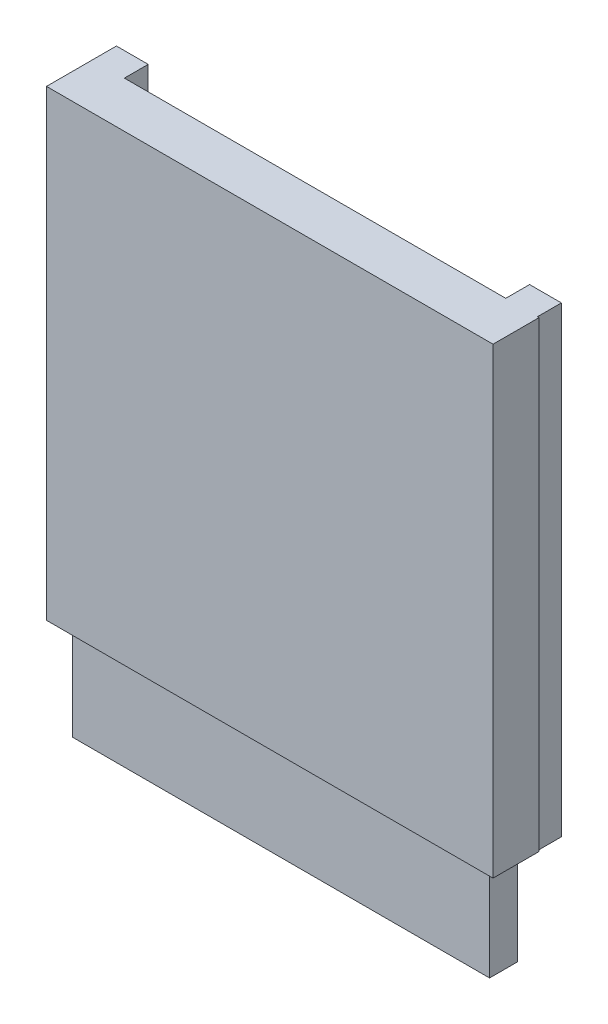
ISO-10303-21;
HEADER;
FILE_DESCRIPTION(('STEP AP214'),'2;1');
FILE_NAME('part.step','',(''),(''),'','','');
FILE_SCHEMA(('AUTOMOTIVE_DESIGN { 1 0 10303 214 1 1 1 1 }'));
ENDSEC;
DATA;
#1=APPLICATION_CONTEXT('core data for automotive mechanical design processes');
#2=APPLICATION_PROTOCOL_DEFINITION('international standard','automotive_design',2000,#1);
#3=PRODUCT_CONTEXT('',#1,'mechanical');
#4=PRODUCT('Part','Part','',(#3));
#5=PRODUCT_RELATED_PRODUCT_CATEGORY('part','',(#4));
#6=PRODUCT_DEFINITION_FORMATION('','',#4);
#7=PRODUCT_DEFINITION_CONTEXT('part definition',#1,'design');
#8=PRODUCT_DEFINITION('design','',#6,#7);
#9=PRODUCT_DEFINITION_SHAPE('','',#8);
#10=(LENGTH_UNIT() NAMED_UNIT(*) SI_UNIT(.MILLI.,.METRE.));
#11=(NAMED_UNIT(*) PLANE_ANGLE_UNIT() SI_UNIT($,.RADIAN.));
#12=(NAMED_UNIT(*) SI_UNIT($,.STERADIAN.) SOLID_ANGLE_UNIT());
#13=UNCERTAINTY_MEASURE_WITH_UNIT(LENGTH_MEASURE(1.E-05),#10,'distance_accuracy_value','');
#14=(GEOMETRIC_REPRESENTATION_CONTEXT(3) GLOBAL_UNCERTAINTY_ASSIGNED_CONTEXT((#13)) GLOBAL_UNIT_ASSIGNED_CONTEXT((#10,
#11,#12)) REPRESENTATION_CONTEXT('',''));
#15=CARTESIAN_POINT('',(0.,0.,0.));
#16=DIRECTION('',(0.,0.,1.));
#17=DIRECTION('',(1.,0.,0.));
#18=AXIS2_PLACEMENT_3D('',#15,#16,#17);
#19=CARTESIAN_POINT('',(26.5754791182011,0.,1.75922698570954));
#20=DIRECTION('',(0.,1.,0.));
#21=DIRECTION('',(0.,0.,1.));
#22=AXIS2_PLACEMENT_3D('',#19,#20,#21);
#23=PLANE('',#22);
#24=DIRECTION('',(0.,0.,1.));
#25=VECTOR('',#24,1.);
#26=CARTESIAN_POINT('',(26.5754791182011,0.,4.03163199291016));
#27=LINE('',#26,#25);
#28=CARTESIAN_POINT('',(26.5754791182011,0.,1.75922698570954));
#29=VERTEX_POINT('',#28);
#30=CARTESIAN_POINT('',(26.5754791182011,0.,4.03163199291016));
#31=VERTEX_POINT('',#30);
#32=EDGE_CURVE('E196',#29,#31,#27,.T.);
#33=ORIENTED_EDGE('',*,*,#32,.T.);
#34=DIRECTION('',(-1.,0.,0.));
#35=VECTOR('',#34,1.);
#36=CARTESIAN_POINT('',(26.5754791182011,0.,4.03163199291016));
#37=LINE('',#36,#35);
#38=CARTESIAN_POINT('',(-0.506607953915927,0.,4.03163199291016));
#39=VERTEX_POINT('',#38);
#40=EDGE_CURVE('E199',#31,#39,#37,.T.);
#41=ORIENTED_EDGE('',*,*,#40,.T.);
#42=DIRECTION('',(0.,0.,-1.));
#43=VECTOR('',#42,1.);
#44=CARTESIAN_POINT('',(-0.506607953915927,0.,4.03163199291016));
#45=LINE('',#44,#43);
#46=CARTESIAN_POINT('',(-0.506607953915927,0.,1.75922698570954));
#47=VERTEX_POINT('',#46);
#48=EDGE_CURVE('E202',#39,#47,#45,.T.);
#49=ORIENTED_EDGE('',*,*,#48,.T.);
#50=DIRECTION('',(1.,0.,0.));
#51=VECTOR('',#50,1.);
#52=CARTESIAN_POINT('',(26.5754791182011,0.,1.75922698570954));
#53=LINE('',#52,#51);
#54=EDGE_CURVE('E205',#47,#29,#53,.T.);
#55=ORIENTED_EDGE('',*,*,#54,.T.);
#56=EDGE_LOOP('',(#33,#41,#49,#55));
#57=FACE_BOUND('',#56,.T.);
#58=DIRECTION('',(0.,0.,1.));
#59=VECTOR('',#58,1.);
#60=CARTESIAN_POINT('',(26.233061925335,0.,3.75147247147447));
#61=LINE('',#60,#59);
#62=CARTESIAN_POINT('',(26.233061925335,0.,2.00825767143015));
#63=VERTEX_POINT('',#62);
#64=CARTESIAN_POINT('',(26.233061925335,0.,3.75147247147447));
#65=VERTEX_POINT('',#64);
#66=EDGE_CURVE('E153',#63,#65,#61,.T.);
#67=ORIENTED_EDGE('',*,*,#66,.F.);
#68=DIRECTION('',(1.,0.,0.));
#69=VECTOR('',#68,1.);
#70=CARTESIAN_POINT('',(26.233061925335,0.,2.00825767143015));
#71=LINE('',#70,#69);
#72=CARTESIAN_POINT('',(0.,0.,2.00825767143015));
#73=VERTEX_POINT('',#72);
#74=EDGE_CURVE('E155',#73,#63,#71,.T.);
#75=ORIENTED_EDGE('',*,*,#74,.F.);
#76=DIRECTION('',(0.,0.,-1.));
#77=VECTOR('',#76,1.);
#78=CARTESIAN_POINT('',(0.,0.,3.75147247147447));
#79=LINE('',#78,#77);
#80=CARTESIAN_POINT('',(0.,0.,3.75147247147447));
#81=VERTEX_POINT('',#80);
#82=EDGE_CURVE('E52',#81,#73,#79,.T.);
#83=ORIENTED_EDGE('',*,*,#82,.F.);
#84=DIRECTION('',(-1.,0.,0.));
#85=VECTOR('',#84,1.);
#86=CARTESIAN_POINT('',(26.233061925335,0.,3.75147247147447));
#87=LINE('',#86,#85);
#88=EDGE_CURVE('E47',#65,#81,#87,.T.);
#89=ORIENTED_EDGE('',*,*,#88,.F.);
#90=EDGE_LOOP('',(#67,#75,#83,#89));
#91=FACE_BOUND('',#90,.T.);
#92=ADVANCED_FACE('F29',(#57,#91),#23,.F.);
#93=CARTESIAN_POINT('',(-0.999999999999997,-26.3,1.5));
#94=DIRECTION('',(0.,0.,1.));
#95=DIRECTION('',(1.,0.,0.));
#96=AXIS2_PLACEMENT_3D('',#93,#94,#95);
#97=PLANE('',#96);
#98=DIRECTION('',(0.,-1.,0.));
#99=VECTOR('',#98,1.);
#100=CARTESIAN_POINT('',(25.,2.8,1.5));
#101=LINE('',#100,#99);
#102=CARTESIAN_POINT('',(25.,2.8,1.5));
#103=VERTEX_POINT('',#102);
#104=CARTESIAN_POINT('',(25.,-26.3,1.5));
#105=VERTEX_POINT('',#104);
#106=EDGE_CURVE('E226',#103,#105,#101,.T.);
#107=ORIENTED_EDGE('',*,*,#106,.T.);
#108=DIRECTION('',(1.,0.,0.));
#109=VECTOR('',#108,1.);
#110=CARTESIAN_POINT('',(-0.999999999999997,-26.3,1.5));
#111=LINE('',#110,#109);
#112=CARTESIAN_POINT('',(1.,-26.3,1.5));
#113=VERTEX_POINT('',#112);
#114=EDGE_CURVE('E256',#113,#105,#111,.T.);
#115=ORIENTED_EDGE('',*,*,#114,.F.);
#116=DIRECTION('',(0.,1.,0.));
#117=VECTOR('',#116,1.);
#118=CARTESIAN_POINT('',(1.,2.8,1.5));
#119=LINE('',#118,#117);
#120=CARTESIAN_POINT('',(1.,2.8,1.5));
#121=VERTEX_POINT('',#120);
#122=EDGE_CURVE('E267',#113,#121,#119,.T.);
#123=ORIENTED_EDGE('',*,*,#122,.T.);
#124=DIRECTION('',(-1.,0.,0.));
#125=VECTOR('',#124,1.);
#126=CARTESIAN_POINT('',(-1.,2.8,1.5));
#127=LINE('',#126,#125);
#128=EDGE_CURVE('E33',#103,#121,#127,.T.);
#129=ORIENTED_EDGE('',*,*,#128,.F.);
#130=EDGE_LOOP('',(#107,#115,#123,#129));
#131=FACE_BOUND('',#130,.T.);
#132=ADVANCED_FACE('F352',(#131),#97,.F.);
#133=DIRECTION('',(0.,1.,0.));
#134=VECTOR('',#133,1.);
#135=CARTESIAN_POINT('',(27.,2.8,1.5));
#136=LINE('',#135,#134);
#137=CARTESIAN_POINT('',(27.,-26.3,1.5));
#138=VERTEX_POINT('',#137);
#139=CARTESIAN_POINT('',(27.,2.8,1.5));
#140=VERTEX_POINT('',#139);
#141=EDGE_CURVE('E229',#138,#140,#136,.T.);
#142=ORIENTED_EDGE('',*,*,#141,.T.);
#143=CARTESIAN_POINT('',(27.1,2.8,1.5));
#144=VERTEX_POINT('',#143);
#145=EDGE_CURVE('E315',#144,#140,#127,.T.);
#146=ORIENTED_EDGE('',*,*,#145,.F.);
#147=DIRECTION('',(0.,1.,0.));
#148=VECTOR('',#147,1.);
#149=CARTESIAN_POINT('',(27.1,2.8,1.5));
#150=LINE('',#149,#148);
#151=CARTESIAN_POINT('',(27.1,-26.3,1.5));
#152=VERTEX_POINT('',#151);
#153=EDGE_CURVE('E253',#152,#144,#150,.T.);
#154=ORIENTED_EDGE('',*,*,#153,.F.);
#155=EDGE_CURVE('E250',#138,#152,#111,.T.);
#156=ORIENTED_EDGE('',*,*,#155,.F.);
#157=EDGE_LOOP('',(#142,#146,#154,#156));
#158=FACE_BOUND('',#157,.T.);
#159=ADVANCED_FACE('F340',(#158),#97,.F.);
#160=CARTESIAN_POINT('',(0.,0.,-0.508));
#161=DIRECTION('',(0.,0.,1.));
#162=DIRECTION('',(1.,0.,0.));
#163=AXIS2_PLACEMENT_3D('',#160,#161,#162);
#164=CYLINDRICAL_SURFACE('',#163,0.5);
#165=CARTESIAN_POINT('',(0.,0.,-0.508));
#166=DIRECTION('',(0.,0.,1.));
#167=DIRECTION('',(1.,0.,0.));
#168=AXIS2_PLACEMENT_3D('',#165,#166,#167);
#169=CIRCLE('',#168,0.5);
#170=CARTESIAN_POINT('',(0.5,0.,-0.508));
#171=VERTEX_POINT('',#170);
#172=EDGE_CURVE('E11',#171,#171,#169,.T.);
#173=ORIENTED_EDGE('',*,*,#172,.T.);
#174=EDGE_LOOP('',(#173));
#175=FACE_BOUND('',#174,.T.);
#176=CARTESIAN_POINT('',(0.,0.,0.));
#177=DIRECTION('',(0.,0.,1.));
#178=DIRECTION('',(1.,0.,0.));
#179=AXIS2_PLACEMENT_3D('',#176,#177,#178);
#180=CIRCLE('',#179,0.5);
#181=CARTESIAN_POINT('',(0.5,0.,0.));
#182=VERTEX_POINT('',#181);
#183=EDGE_CURVE('E39',#182,#182,#180,.T.);
#184=ORIENTED_EDGE('',*,*,#183,.F.);
#185=EDGE_LOOP('',(#184));
#186=FACE_BOUND('',#185,.T.);
#187=ADVANCED_FACE('F31',(#175,#186),#164,.T.);
#188=CARTESIAN_POINT('',(0.,0.,-0.508));
#189=DIRECTION('',(0.,0.,1.));
#190=DIRECTION('',(1.,0.,0.));
#191=AXIS2_PLACEMENT_3D('',#188,#189,#190);
#192=PLANE('',#191);
#193=ORIENTED_EDGE('',*,*,#172,.F.);
#194=EDGE_LOOP('',(#193));
#195=FACE_BOUND('',#194,.T.);
#196=ADVANCED_FACE('F417',(#195),#192,.F.);
#197=CARTESIAN_POINT('',(-1.,2.8,1.5));
#198=DIRECTION('',(1.,0.,0.));
#199=DIRECTION('',(0.,1.,0.));
#200=AXIS2_PLACEMENT_3D('',#197,#198,#199);
#201=PLANE('',#200);
#202=DIRECTION('',(0.,-1.,0.));
#203=VECTOR('',#202,1.);
#204=CARTESIAN_POINT('',(-1.,2.8,0.));
#205=LINE('',#204,#203);
#206=CARTESIAN_POINT('',(-1.,2.8,0.));
#207=VERTEX_POINT('',#206);
#208=CARTESIAN_POINT('',(-0.999999999999997,-26.3,0.));
#209=VERTEX_POINT('',#208);
#210=EDGE_CURVE('E299',#207,#209,#205,.T.);
#211=ORIENTED_EDGE('',*,*,#210,.T.);
#212=DIRECTION('',(0.,0.,-1.));
#213=VECTOR('',#212,1.);
#214=CARTESIAN_POINT('',(-0.999999999999997,-26.3,1.5));
#215=LINE('',#214,#213);
#216=CARTESIAN_POINT('',(-0.999999999999997,-26.3,4.4));
#217=VERTEX_POINT('',#216);
#218=EDGE_CURVE('E265',#217,#209,#215,.T.);
#219=ORIENTED_EDGE('',*,*,#218,.F.);
#220=DIRECTION('',(0.,-1.,0.));
#221=VECTOR('',#220,1.);
#222=CARTESIAN_POINT('',(-1.,2.8,4.4));
#223=LINE('',#222,#221);
#224=CARTESIAN_POINT('',(-1.,2.8,4.4));
#225=VERTEX_POINT('',#224);
#226=EDGE_CURVE('E317',#225,#217,#223,.T.);
#227=ORIENTED_EDGE('',*,*,#226,.F.);
#228=DIRECTION('',(0.,0.,-1.));
#229=VECTOR('',#228,1.);
#230=CARTESIAN_POINT('',(-1.,2.8,1.5));
#231=LINE('',#230,#229);
#232=EDGE_CURVE('E271',#225,#207,#231,.T.);
#233=ORIENTED_EDGE('',*,*,#232,.T.);
#234=EDGE_LOOP('',(#211,#219,#227,#233));
#235=FACE_BOUND('',#234,.T.);
#236=ADVANCED_FACE('F332',(#235),#201,.F.);
#237=CARTESIAN_POINT('',(-0.999999999999997,-26.3,1.5));
#238=DIRECTION('',(0.,1.,0.));
#239=DIRECTION('',(0.,0.,1.));
#240=AXIS2_PLACEMENT_3D('',#237,#238,#239);
#241=PLANE('',#240);
#242=DIRECTION('',(-1.,0.,0.));
#243=VECTOR('',#242,1.);
#244=CARTESIAN_POINT('',(26.5754791182011,-26.3,4.03163199291016));
#245=LINE('',#244,#243);
#246=CARTESIAN_POINT('',(26.5754791182011,-26.3,4.03163199291016));
#247=VERTEX_POINT('',#246);
#248=CARTESIAN_POINT('',(-0.506607953915927,-26.3,4.03163199291016));
#249=VERTEX_POINT('',#248);
#250=EDGE_CURVE('E187',#247,#249,#245,.T.);
#251=ORIENTED_EDGE('',*,*,#250,.F.);
#252=DIRECTION('',(0.,0.,1.));
#253=VECTOR('',#252,1.);
#254=CARTESIAN_POINT('',(26.5754791182011,-26.3,4.03163199291016));
#255=LINE('',#254,#253);
#256=CARTESIAN_POINT('',(26.5754791182011,-26.3,1.75922698570954));
#257=VERTEX_POINT('',#256);
#258=EDGE_CURVE('E185',#257,#247,#255,.T.);
#259=ORIENTED_EDGE('',*,*,#258,.F.);
#260=DIRECTION('',(1.,0.,0.));
#261=VECTOR('',#260,1.);
#262=CARTESIAN_POINT('',(26.5754791182011,-26.3,1.75922698570954));
#263=LINE('',#262,#261);
#264=CARTESIAN_POINT('',(-0.506607953915927,-26.3,1.75922698570954));
#265=VERTEX_POINT('',#264);
#266=EDGE_CURVE('E193',#265,#257,#263,.T.);
#267=ORIENTED_EDGE('',*,*,#266,.F.);
#268=DIRECTION('',(0.,0.,-1.));
#269=VECTOR('',#268,1.);
#270=CARTESIAN_POINT('',(-0.506607953915927,-26.3,4.03163199291016));
#271=LINE('',#270,#269);
#272=EDGE_CURVE('E190',#249,#265,#271,.T.);
#273=ORIENTED_EDGE('',*,*,#272,.F.);
#274=EDGE_LOOP('',(#251,#259,#267,#273));
#275=FACE_BOUND('',#274,.T.);
#276=DIRECTION('',(1.,0.,0.));
#277=VECTOR('',#276,1.);
#278=CARTESIAN_POINT('',(-0.999999999999997,-26.3,0.));
#279=LINE('',#278,#277);
#280=CARTESIAN_POINT('',(1.,-26.3,0.));
#281=VERTEX_POINT('',#280);
#282=EDGE_CURVE('E300',#209,#281,#279,.T.);
#283=ORIENTED_EDGE('',*,*,#282,.T.);
#284=DIRECTION('',(0.,0.,-1.));
#285=VECTOR('',#284,1.);
#286=CARTESIAN_POINT('',(1.,-26.3,1.5));
#287=LINE('',#286,#285);
#288=EDGE_CURVE('E262',#113,#281,#287,.T.);
#289=ORIENTED_EDGE('',*,*,#288,.F.);
#290=ORIENTED_EDGE('',*,*,#114,.T.);
#291=DIRECTION('',(0.,0.,-1.));
#292=VECTOR('',#291,1.);
#293=CARTESIAN_POINT('',(25.,-26.3,1.5));
#294=LINE('',#293,#292);
#295=CARTESIAN_POINT('',(25.,-26.3,0.));
#296=VERTEX_POINT('',#295);
#297=EDGE_CURVE('E241',#105,#296,#294,.T.);
#298=ORIENTED_EDGE('',*,*,#297,.T.);
#299=DIRECTION('',(1.,0.,0.));
#300=VECTOR('',#299,1.);
#301=CARTESIAN_POINT('',(25.,-26.3,0.));
#302=LINE('',#301,#300);
#303=CARTESIAN_POINT('',(27.,-26.3,0.));
#304=VERTEX_POINT('',#303);
#305=EDGE_CURVE('E220',#296,#304,#302,.T.);
#306=ORIENTED_EDGE('',*,*,#305,.T.);
#307=DIRECTION('',(0.,0.,-1.));
#308=VECTOR('',#307,1.);
#309=CARTESIAN_POINT('',(27.,-26.3,1.5));
#310=LINE('',#309,#308);
#311=EDGE_CURVE('E238',#138,#304,#310,.T.);
#312=ORIENTED_EDGE('',*,*,#311,.F.);
#313=ORIENTED_EDGE('',*,*,#155,.T.);
#314=DIRECTION('',(0.,0.,-1.));
#315=VECTOR('',#314,1.);
#316=CARTESIAN_POINT('',(27.1,-26.3,4.4));
#317=LINE('',#316,#315);
#318=CARTESIAN_POINT('',(27.1,-26.3,4.4));
#319=VERTEX_POINT('',#318);
#320=EDGE_CURVE('E302',#319,#152,#317,.T.);
#321=ORIENTED_EDGE('',*,*,#320,.F.);
#322=DIRECTION('',(1.,0.,0.));
#323=VECTOR('',#322,1.);
#324=CARTESIAN_POINT('',(-0.999999999999997,-26.3,4.4));
#325=LINE('',#324,#323);
#326=EDGE_CURVE('E323',#217,#319,#325,.T.);
#327=ORIENTED_EDGE('',*,*,#326,.F.);
#328=ORIENTED_EDGE('',*,*,#218,.T.);
#329=EDGE_LOOP('',(#283,#289,#290,#298,#306,#312,#313,#321,#327,#328));
#330=FACE_BOUND('',#329,.T.);
#331=ADVANCED_FACE('F335',(#275,#330),#241,.F.);
#332=CARTESIAN_POINT('',(1.,2.8,1.5));
#333=DIRECTION('',(-1.,0.,0.));
#334=DIRECTION('',(0.,-1.,0.));
#335=AXIS2_PLACEMENT_3D('',#332,#333,#334);
#336=PLANE('',#335);
#337=DIRECTION('',(0.,1.,0.));
#338=VECTOR('',#337,1.);
#339=CARTESIAN_POINT('',(1.,2.8,0.));
#340=LINE('',#339,#338);
#341=CARTESIAN_POINT('',(1.,2.8,0.));
#342=VERTEX_POINT('',#341);
#343=EDGE_CURVE('E297',#281,#342,#340,.T.);
#344=ORIENTED_EDGE('',*,*,#343,.T.);
#345=DIRECTION('',(0.,0.,-1.));
#346=VECTOR('',#345,1.);
#347=CARTESIAN_POINT('',(1.,2.8,1.5));
#348=LINE('',#347,#346);
#349=EDGE_CURVE('E266',#121,#342,#348,.T.);
#350=ORIENTED_EDGE('',*,*,#349,.F.);
#351=ORIENTED_EDGE('',*,*,#122,.F.);
#352=ORIENTED_EDGE('',*,*,#288,.T.);
#353=EDGE_LOOP('',(#344,#350,#351,#352));
#354=FACE_BOUND('',#353,.T.);
#355=ADVANCED_FACE('F355',(#354),#336,.F.);
#356=CARTESIAN_POINT('',(-1.,2.8,1.5));
#357=DIRECTION('',(0.,-1.,0.));
#358=DIRECTION('',(0.,0.,-1.));
#359=AXIS2_PLACEMENT_3D('',#356,#357,#358);
#360=PLANE('',#359);
#361=DIRECTION('',(-1.,0.,0.));
#362=VECTOR('',#361,1.);
#363=CARTESIAN_POINT('',(-1.,2.8,0.));
#364=LINE('',#363,#362);
#365=EDGE_CURVE('E272',#342,#207,#364,.T.);
#366=ORIENTED_EDGE('',*,*,#365,.T.);
#367=ORIENTED_EDGE('',*,*,#232,.F.);
#368=DIRECTION('',(-1.,0.,0.));
#369=VECTOR('',#368,1.);
#370=CARTESIAN_POINT('',(-1.,2.8,4.4));
#371=LINE('',#370,#369);
#372=CARTESIAN_POINT('',(27.1,2.8,4.4));
#373=VERTEX_POINT('',#372);
#374=EDGE_CURVE('E312',#373,#225,#371,.T.);
#375=ORIENTED_EDGE('',*,*,#374,.F.);
#376=DIRECTION('',(0.,0.,-1.));
#377=VECTOR('',#376,1.);
#378=CARTESIAN_POINT('',(27.1,2.8,4.4));
#379=LINE('',#378,#377);
#380=EDGE_CURVE('E305',#373,#144,#379,.T.);
#381=ORIENTED_EDGE('',*,*,#380,.T.);
#382=ORIENTED_EDGE('',*,*,#145,.T.);
#383=DIRECTION('',(0.,0.,-1.));
#384=VECTOR('',#383,1.);
#385=CARTESIAN_POINT('',(27.,2.8,1.5));
#386=LINE('',#385,#384);
#387=CARTESIAN_POINT('',(27.,2.8,0.));
#388=VERTEX_POINT('',#387);
#389=EDGE_CURVE('E235',#140,#388,#386,.T.);
#390=ORIENTED_EDGE('',*,*,#389,.T.);
#391=DIRECTION('',(-1.,0.,0.));
#392=VECTOR('',#391,1.);
#393=CARTESIAN_POINT('',(25.,2.8,0.));
#394=LINE('',#393,#392);
#395=CARTESIAN_POINT('',(25.,2.8,0.));
#396=VERTEX_POINT('',#395);
#397=EDGE_CURVE('E224',#388,#396,#394,.T.);
#398=ORIENTED_EDGE('',*,*,#397,.T.);
#399=DIRECTION('',(0.,0.,-1.));
#400=VECTOR('',#399,1.);
#401=CARTESIAN_POINT('',(25.,2.8,1.5));
#402=LINE('',#401,#400);
#403=EDGE_CURVE('E232',#103,#396,#402,.T.);
#404=ORIENTED_EDGE('',*,*,#403,.F.);
#405=ORIENTED_EDGE('',*,*,#128,.T.);
#406=ORIENTED_EDGE('',*,*,#349,.T.);
#407=EDGE_LOOP('',(#366,#367,#375,#381,#382,#390,#398,#404,#405,#406));
#408=FACE_BOUND('',#407,.T.);
#409=ADVANCED_FACE('F288',(#408),#360,.F.);
#410=CARTESIAN_POINT('',(-0.999999999999997,-26.3,0.));
#411=DIRECTION('',(0.,0.,1.));
#412=DIRECTION('',(1.,0.,0.));
#413=AXIS2_PLACEMENT_3D('',#410,#411,#412);
#414=PLANE('',#413);
#415=ORIENTED_EDGE('',*,*,#183,.T.);
#416=EDGE_LOOP('',(#415));
#417=FACE_BOUND('',#416,.T.);
#418=ORIENTED_EDGE('',*,*,#210,.F.);
#419=ORIENTED_EDGE('',*,*,#365,.F.);
#420=ORIENTED_EDGE('',*,*,#343,.F.);
#421=ORIENTED_EDGE('',*,*,#282,.F.);
#422=EDGE_LOOP('',(#418,#419,#420,#421));
#423=FACE_BOUND('',#422,.T.);
#424=ADVANCED_FACE('F296',(#417,#423),#414,.F.);
#425=CARTESIAN_POINT('',(27.1,2.8,4.4));
#426=DIRECTION('',(-1.,0.,0.));
#427=DIRECTION('',(0.,-1.,0.));
#428=AXIS2_PLACEMENT_3D('',#425,#426,#427);
#429=PLANE('',#428);
#430=ORIENTED_EDGE('',*,*,#153,.T.);
#431=ORIENTED_EDGE('',*,*,#380,.F.);
#432=DIRECTION('',(0.,1.,0.));
#433=VECTOR('',#432,1.);
#434=CARTESIAN_POINT('',(27.1,2.8,4.4));
#435=LINE('',#434,#433);
#436=EDGE_CURVE('E325',#319,#373,#435,.T.);
#437=ORIENTED_EDGE('',*,*,#436,.F.);
#438=ORIENTED_EDGE('',*,*,#320,.T.);
#439=EDGE_LOOP('',(#430,#431,#437,#438));
#440=FACE_BOUND('',#439,.T.);
#441=ADVANCED_FACE('F337',(#440),#429,.F.);
#442=CARTESIAN_POINT('',(-0.999999999999997,-26.3,4.4));
#443=DIRECTION('',(0.,0.,1.));
#444=DIRECTION('',(1.,0.,0.));
#445=AXIS2_PLACEMENT_3D('',#442,#443,#444);
#446=PLANE('',#445);
#447=ORIENTED_EDGE('',*,*,#226,.T.);
#448=ORIENTED_EDGE('',*,*,#326,.T.);
#449=ORIENTED_EDGE('',*,*,#436,.T.);
#450=ORIENTED_EDGE('',*,*,#374,.T.);
#451=EDGE_LOOP('',(#447,#448,#449,#450));
#452=FACE_BOUND('',#451,.T.);
#453=ADVANCED_FACE('F330',(#452),#446,.T.);
#454=CARTESIAN_POINT('',(26.,0.,-0.508));
#455=DIRECTION('',(0.,0.,1.));
#456=DIRECTION('',(1.,0.,0.));
#457=AXIS2_PLACEMENT_3D('',#454,#455,#456);
#458=CYLINDRICAL_SURFACE('',#457,0.499999999999999);
#459=CARTESIAN_POINT('',(26.,0.,-0.508));
#460=DIRECTION('',(0.,0.,1.));
#461=DIRECTION('',(1.,0.,0.));
#462=AXIS2_PLACEMENT_3D('',#459,#460,#461);
#463=CIRCLE('',#462,0.499999999999999);
#464=CARTESIAN_POINT('',(26.5,0.,-0.508));
#465=VERTEX_POINT('',#464);
#466=EDGE_CURVE('E247',#465,#465,#463,.T.);
#467=ORIENTED_EDGE('',*,*,#466,.T.);
#468=EDGE_LOOP('',(#467));
#469=FACE_BOUND('',#468,.T.);
#470=CARTESIAN_POINT('',(26.,0.,0.));
#471=DIRECTION('',(0.,0.,1.));
#472=DIRECTION('',(1.,0.,0.));
#473=AXIS2_PLACEMENT_3D('',#470,#471,#472);
#474=CIRCLE('',#473,0.499999999999999);
#475=CARTESIAN_POINT('',(26.5,0.,0.));
#476=VERTEX_POINT('',#475);
#477=EDGE_CURVE('E244',#476,#476,#474,.T.);
#478=ORIENTED_EDGE('',*,*,#477,.F.);
#479=EDGE_LOOP('',(#478));
#480=FACE_BOUND('',#479,.T.);
#481=ADVANCED_FACE('F401',(#469,#480),#458,.T.);
#482=CARTESIAN_POINT('',(26.,0.,-0.508));
#483=DIRECTION('',(0.,0.,1.));
#484=DIRECTION('',(1.,0.,0.));
#485=AXIS2_PLACEMENT_3D('',#482,#483,#484);
#486=PLANE('',#485);
#487=ORIENTED_EDGE('',*,*,#466,.F.);
#488=EDGE_LOOP('',(#487));
#489=FACE_BOUND('',#488,.T.);
#490=ADVANCED_FACE('F398',(#489),#486,.F.);
#491=CARTESIAN_POINT('',(25.,2.8,1.5));
#492=DIRECTION('',(1.,0.,0.));
#493=DIRECTION('',(0.,1.,0.));
#494=AXIS2_PLACEMENT_3D('',#491,#492,#493);
#495=PLANE('',#494);
#496=DIRECTION('',(0.,-1.,0.));
#497=VECTOR('',#496,1.);
#498=CARTESIAN_POINT('',(25.,2.8,0.));
#499=LINE('',#498,#497);
#500=EDGE_CURVE('E211',#396,#296,#499,.T.);
#501=ORIENTED_EDGE('',*,*,#500,.T.);
#502=ORIENTED_EDGE('',*,*,#297,.F.);
#503=ORIENTED_EDGE('',*,*,#106,.F.);
#504=ORIENTED_EDGE('',*,*,#403,.T.);
#505=EDGE_LOOP('',(#501,#502,#503,#504));
#506=FACE_BOUND('',#505,.T.);
#507=ADVANCED_FACE('F350',(#506),#495,.F.);
#508=CARTESIAN_POINT('',(27.,2.8,1.5));
#509=DIRECTION('',(-1.,0.,0.));
#510=DIRECTION('',(0.,-1.,0.));
#511=AXIS2_PLACEMENT_3D('',#508,#509,#510);
#512=PLANE('',#511);
#513=DIRECTION('',(0.,1.,0.));
#514=VECTOR('',#513,1.);
#515=CARTESIAN_POINT('',(27.,2.8,0.));
#516=LINE('',#515,#514);
#517=EDGE_CURVE('E222',#304,#388,#516,.T.);
#518=ORIENTED_EDGE('',*,*,#517,.T.);
#519=ORIENTED_EDGE('',*,*,#389,.F.);
#520=ORIENTED_EDGE('',*,*,#141,.F.);
#521=ORIENTED_EDGE('',*,*,#311,.T.);
#522=EDGE_LOOP('',(#518,#519,#520,#521));
#523=FACE_BOUND('',#522,.T.);
#524=ADVANCED_FACE('F343',(#523),#512,.F.);
#525=CARTESIAN_POINT('',(25.,-26.3,0.));
#526=DIRECTION('',(0.,0.,1.));
#527=DIRECTION('',(1.,0.,0.));
#528=AXIS2_PLACEMENT_3D('',#525,#526,#527);
#529=PLANE('',#528);
#530=ORIENTED_EDGE('',*,*,#477,.T.);
#531=EDGE_LOOP('',(#530));
#532=FACE_BOUND('',#531,.T.);
#533=ORIENTED_EDGE('',*,*,#500,.F.);
#534=ORIENTED_EDGE('',*,*,#397,.F.);
#535=ORIENTED_EDGE('',*,*,#517,.F.);
#536=ORIENTED_EDGE('',*,*,#305,.F.);
#537=EDGE_LOOP('',(#533,#534,#535,#536));
#538=FACE_BOUND('',#537,.T.);
#539=ADVANCED_FACE('F348',(#532,#538),#529,.F.);
#540=CARTESIAN_POINT('',(26.5754791182011,0.,4.03163199291016));
#541=DIRECTION('',(1.,0.,0.));
#542=DIRECTION('',(0.,0.,-1.));
#543=AXIS2_PLACEMENT_3D('',#540,#541,#542);
#544=PLANE('',#543);
#545=ORIENTED_EDGE('',*,*,#258,.T.);
#546=DIRECTION('',(0.,-1.,0.));
#547=VECTOR('',#546,1.);
#548=CARTESIAN_POINT('',(26.5754791182011,0.,4.03163199291016));
#549=LINE('',#548,#547);
#550=EDGE_CURVE('E208',#31,#247,#549,.T.);
#551=ORIENTED_EDGE('',*,*,#550,.F.);
#552=ORIENTED_EDGE('',*,*,#32,.F.);
#553=DIRECTION('',(0.,-1.,0.));
#554=VECTOR('',#553,1.);
#555=CARTESIAN_POINT('',(26.5754791182011,0.,1.75922698570954));
#556=LINE('',#555,#554);
#557=EDGE_CURVE('E209',#29,#257,#556,.T.);
#558=ORIENTED_EDGE('',*,*,#557,.T.);
#559=EDGE_LOOP('',(#545,#551,#552,#558));
#560=FACE_BOUND('',#559,.T.);
#561=ADVANCED_FACE('F379',(#560),#544,.F.);
#562=CARTESIAN_POINT('',(26.5754791182011,0.,1.75922698570954));
#563=DIRECTION('',(0.,0.,-1.));
#564=DIRECTION('',(-1.,0.,0.));
#565=AXIS2_PLACEMENT_3D('',#562,#563,#564);
#566=PLANE('',#565);
#567=ORIENTED_EDGE('',*,*,#266,.T.);
#568=ORIENTED_EDGE('',*,*,#557,.F.);
#569=ORIENTED_EDGE('',*,*,#54,.F.);
#570=DIRECTION('',(0.,-1.,0.));
#571=VECTOR('',#570,1.);
#572=CARTESIAN_POINT('',(-0.506607953915927,0.,1.75922698570954));
#573=LINE('',#572,#571);
#574=EDGE_CURVE('E212',#47,#265,#573,.T.);
#575=ORIENTED_EDGE('',*,*,#574,.T.);
#576=EDGE_LOOP('',(#567,#568,#569,#575));
#577=FACE_BOUND('',#576,.T.);
#578=ADVANCED_FACE('F375',(#577),#566,.F.);
#579=CARTESIAN_POINT('',(-0.506607953915927,0.,4.03163199291016));
#580=DIRECTION('',(-1.,0.,0.));
#581=DIRECTION('',(0.,0.,1.));
#582=AXIS2_PLACEMENT_3D('',#579,#580,#581);
#583=PLANE('',#582);
#584=ORIENTED_EDGE('',*,*,#272,.T.);
#585=ORIENTED_EDGE('',*,*,#574,.F.);
#586=ORIENTED_EDGE('',*,*,#48,.F.);
#587=DIRECTION('',(0.,-1.,0.));
#588=VECTOR('',#587,1.);
#589=CARTESIAN_POINT('',(-0.506607953915927,0.,4.03163199291016));
#590=LINE('',#589,#588);
#591=EDGE_CURVE('E214',#39,#249,#590,.T.);
#592=ORIENTED_EDGE('',*,*,#591,.T.);
#593=EDGE_LOOP('',(#584,#585,#586,#592));
#594=FACE_BOUND('',#593,.T.);
#595=ADVANCED_FACE('F378',(#594),#583,.F.);
#596=CARTESIAN_POINT('',(26.5754791182011,0.,4.03163199291016));
#597=DIRECTION('',(0.,0.,1.));
#598=DIRECTION('',(1.,0.,0.));
#599=AXIS2_PLACEMENT_3D('',#596,#597,#598);
#600=PLANE('',#599);
#601=ORIENTED_EDGE('',*,*,#250,.T.);
#602=ORIENTED_EDGE('',*,*,#591,.F.);
#603=ORIENTED_EDGE('',*,*,#40,.F.);
#604=ORIENTED_EDGE('',*,*,#550,.T.);
#605=EDGE_LOOP('',(#601,#602,#603,#604));
#606=FACE_BOUND('',#605,.T.);
#607=ADVANCED_FACE('F383',(#606),#600,.F.);
#608=CARTESIAN_POINT('',(26.233061925335,-32.5,3.75147247147447));
#609=DIRECTION('',(-1.,0.,0.));
#610=DIRECTION('',(0.,0.,1.));
#611=AXIS2_PLACEMENT_3D('',#608,#609,#610);
#612=PLANE('',#611);
#613=ORIENTED_EDGE('',*,*,#66,.T.);
#614=DIRECTION('',(0.,1.,0.));
#615=VECTOR('',#614,1.);
#616=CARTESIAN_POINT('',(26.233061925335,-32.5,3.75147247147447));
#617=LINE('',#616,#615);
#618=CARTESIAN_POINT('',(26.233061925335,-32.5,3.75147247147447));
#619=VERTEX_POINT('',#618);
#620=EDGE_CURVE('E183',#619,#65,#617,.T.);
#621=ORIENTED_EDGE('',*,*,#620,.F.);
#622=DIRECTION('',(0.,0.,1.));
#623=VECTOR('',#622,1.);
#624=CARTESIAN_POINT('',(26.233061925335,-32.5,3.75147247147447));
#625=LINE('',#624,#623);
#626=CARTESIAN_POINT('',(26.233061925335,-32.5,2.00825767143015));
#627=VERTEX_POINT('',#626);
#628=EDGE_CURVE('E169',#627,#619,#625,.T.);
#629=ORIENTED_EDGE('',*,*,#628,.F.);
#630=DIRECTION('',(0.,1.,0.));
#631=VECTOR('',#630,1.);
#632=CARTESIAN_POINT('',(26.233061925335,-32.5,2.00825767143015));
#633=LINE('',#632,#631);
#634=EDGE_CURVE('E165',#627,#63,#633,.T.);
#635=ORIENTED_EDGE('',*,*,#634,.T.);
#636=EDGE_LOOP('',(#613,#621,#629,#635));
#637=FACE_BOUND('',#636,.T.);
#638=ADVANCED_FACE('F171',(#637),#612,.F.);
#639=CARTESIAN_POINT('',(26.233061925335,-32.5,3.75147247147447));
#640=DIRECTION('',(0.,0.,-1.));
#641=DIRECTION('',(-1.,0.,0.));
#642=AXIS2_PLACEMENT_3D('',#639,#640,#641);
#643=PLANE('',#642);
#644=ORIENTED_EDGE('',*,*,#88,.T.);
#645=DIRECTION('',(0.,1.,0.));
#646=VECTOR('',#645,1.);
#647=CARTESIAN_POINT('',(0.,-32.5,3.75147247147447));
#648=LINE('',#647,#646);
#649=CARTESIAN_POINT('',(0.,-32.5,3.75147247147447));
#650=VERTEX_POINT('',#649);
#651=EDGE_CURVE('E175',#650,#81,#648,.T.);
#652=ORIENTED_EDGE('',*,*,#651,.F.);
#653=DIRECTION('',(-1.,0.,0.));
#654=VECTOR('',#653,1.);
#655=CARTESIAN_POINT('',(26.233061925335,-32.5,3.75147247147447));
#656=LINE('',#655,#654);
#657=EDGE_CURVE('E543',#619,#650,#656,.T.);
#658=ORIENTED_EDGE('',*,*,#657,.F.);
#659=ORIENTED_EDGE('',*,*,#620,.T.);
#660=EDGE_LOOP('',(#644,#652,#658,#659));
#661=FACE_BOUND('',#660,.T.);
#662=ADVANCED_FACE('F504',(#661),#643,.F.);
#663=CARTESIAN_POINT('',(0.,-32.5,3.75147247147447));
#664=DIRECTION('',(1.,0.,0.));
#665=DIRECTION('',(0.,0.,-1.));
#666=AXIS2_PLACEMENT_3D('',#663,#664,#665);
#667=PLANE('',#666);
#668=ORIENTED_EDGE('',*,*,#82,.T.);
#669=DIRECTION('',(0.,1.,0.));
#670=VECTOR('',#669,1.);
#671=CARTESIAN_POINT('',(0.,-32.5,2.00825767143015));
#672=LINE('',#671,#670);
#673=CARTESIAN_POINT('',(0.,-32.5,2.00825767143015));
#674=VERTEX_POINT('',#673);
#675=EDGE_CURVE('E168',#674,#73,#672,.T.);
#676=ORIENTED_EDGE('',*,*,#675,.F.);
#677=DIRECTION('',(0.,0.,-1.));
#678=VECTOR('',#677,1.);
#679=CARTESIAN_POINT('',(0.,-32.5,3.75147247147447));
#680=LINE('',#679,#678);
#681=EDGE_CURVE('E177',#650,#674,#680,.T.);
#682=ORIENTED_EDGE('',*,*,#681,.F.);
#683=ORIENTED_EDGE('',*,*,#651,.T.);
#684=EDGE_LOOP('',(#668,#676,#682,#683));
#685=FACE_BOUND('',#684,.T.);
#686=ADVANCED_FACE('F512',(#685),#667,.F.);
#687=CARTESIAN_POINT('',(26.233061925335,-32.5,2.00825767143015));
#688=DIRECTION('',(0.,0.,1.));
#689=DIRECTION('',(1.,0.,0.));
#690=AXIS2_PLACEMENT_3D('',#687,#688,#689);
#691=PLANE('',#690);
#692=ORIENTED_EDGE('',*,*,#74,.T.);
#693=ORIENTED_EDGE('',*,*,#634,.F.);
#694=DIRECTION('',(1.,0.,0.));
#695=VECTOR('',#694,1.);
#696=CARTESIAN_POINT('',(26.233061925335,-32.5,2.00825767143015));
#697=LINE('',#696,#695);
#698=EDGE_CURVE('E173',#674,#627,#697,.T.);
#699=ORIENTED_EDGE('',*,*,#698,.F.);
#700=ORIENTED_EDGE('',*,*,#675,.T.);
#701=EDGE_LOOP('',(#692,#693,#699,#700));
#702=FACE_BOUND('',#701,.T.);
#703=ADVANCED_FACE('F163',(#702),#691,.F.);
#704=CARTESIAN_POINT('',(26.233061925335,-32.5,2.00825767143015));
#705=DIRECTION('',(0.,1.,0.));
#706=DIRECTION('',(0.,0.,1.));
#707=AXIS2_PLACEMENT_3D('',#704,#705,#706);
#708=PLANE('',#707);
#709=ORIENTED_EDGE('',*,*,#628,.T.);
#710=ORIENTED_EDGE('',*,*,#657,.T.);
#711=ORIENTED_EDGE('',*,*,#681,.T.);
#712=ORIENTED_EDGE('',*,*,#698,.T.);
#713=EDGE_LOOP('',(#709,#710,#711,#712));
#714=FACE_BOUND('',#713,.T.);
#715=ADVANCED_FACE('F530',(#714),#708,.F.);
#716=CLOSED_SHELL('',(#92,#132,#159,#187,#196,#236,#331,#355,#409,#424,#441,#453,#481,#490,#507,
#524,#539,#561,#578,#595,#607,#638,#662,#686,#703,#715));
#717=MANIFOLD_SOLID_BREP('B2',#716);
#718=ADVANCED_BREP_SHAPE_REPRESENTATION('',(#18,#717),#14);
#719=SHAPE_DEFINITION_REPRESENTATION(#9,#718);
ENDSEC;
END-ISO-10303-21;
